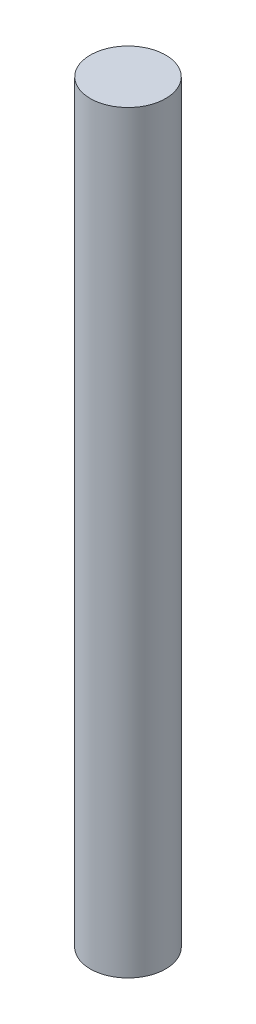
ISO-10303-21;
HEADER;
FILE_DESCRIPTION(('STEP AP214'),'2;1');
FILE_NAME('part.step','',(''),(''),'','','');
FILE_SCHEMA(('AUTOMOTIVE_DESIGN { 1 0 10303 214 1 1 1 1 }'));
ENDSEC;
DATA;
#1=APPLICATION_CONTEXT('core data for automotive mechanical design processes');
#2=APPLICATION_PROTOCOL_DEFINITION('international standard','automotive_design',2000,#1);
#3=PRODUCT_CONTEXT('',#1,'mechanical');
#4=PRODUCT('Part','Part','',(#3));
#5=PRODUCT_RELATED_PRODUCT_CATEGORY('part','',(#4));
#6=PRODUCT_DEFINITION_FORMATION('','',#4);
#7=PRODUCT_DEFINITION_CONTEXT('part definition',#1,'design');
#8=PRODUCT_DEFINITION('design','',#6,#7);
#9=PRODUCT_DEFINITION_SHAPE('','',#8);
#10=(LENGTH_UNIT() NAMED_UNIT(*) SI_UNIT(.MILLI.,.METRE.));
#11=(NAMED_UNIT(*) PLANE_ANGLE_UNIT() SI_UNIT($,.RADIAN.));
#12=(NAMED_UNIT(*) SI_UNIT($,.STERADIAN.) SOLID_ANGLE_UNIT());
#13=UNCERTAINTY_MEASURE_WITH_UNIT(LENGTH_MEASURE(1.E-05),#10,'distance_accuracy_value','');
#14=(GEOMETRIC_REPRESENTATION_CONTEXT(3) GLOBAL_UNCERTAINTY_ASSIGNED_CONTEXT((#13)) GLOBAL_UNIT_ASSIGNED_CONTEXT((#10,
#11,#12)) REPRESENTATION_CONTEXT('',''));
#15=CARTESIAN_POINT('',(0.,0.,0.));
#16=DIRECTION('',(0.,0.,1.));
#17=DIRECTION('',(1.,0.,0.));
#18=AXIS2_PLACEMENT_3D('',#15,#16,#17);
#19=CARTESIAN_POINT('',(0.,30.,0.));
#20=DIRECTION('',(0.,-1.,0.));
#21=DIRECTION('',(0.,0.,-1.));
#22=AXIS2_PLACEMENT_3D('',#19,#20,#21);
#23=CYLINDRICAL_SURFACE('',#22,1.5);
#24=CARTESIAN_POINT('',(0.,30.,0.));
#25=DIRECTION('',(0.,1.,0.));
#26=DIRECTION('',(0.,0.,1.));
#27=AXIS2_PLACEMENT_3D('',#24,#25,#26);
#28=CIRCLE('',#27,1.5);
#29=CARTESIAN_POINT('',(0.,30.,1.5));
#30=VERTEX_POINT('',#29);
#31=EDGE_CURVE('E10',#30,#30,#28,.T.);
#32=ORIENTED_EDGE('',*,*,#31,.F.);
#33=EDGE_LOOP('',(#32));
#34=FACE_BOUND('',#33,.T.);
#35=CARTESIAN_POINT('',(0.,0.,0.));
#36=DIRECTION('',(0.,1.,0.));
#37=DIRECTION('',(0.,0.,1.));
#38=AXIS2_PLACEMENT_3D('',#35,#36,#37);
#39=CIRCLE('',#38,1.5);
#40=CARTESIAN_POINT('',(0.,0.,1.5));
#41=VERTEX_POINT('',#40);
#42=EDGE_CURVE('E32',#41,#41,#39,.T.);
#43=ORIENTED_EDGE('',*,*,#42,.T.);
#44=EDGE_LOOP('',(#43));
#45=FACE_BOUND('',#44,.T.);
#46=ADVANCED_FACE('F29',(#34,#45),#23,.T.);
#47=CARTESIAN_POINT('',(0.,30.,0.));
#48=DIRECTION('',(0.,1.,0.));
#49=DIRECTION('',(0.,0.,1.));
#50=AXIS2_PLACEMENT_3D('',#47,#48,#49);
#51=PLANE('',#50);
#52=ORIENTED_EDGE('',*,*,#31,.T.);
#53=EDGE_LOOP('',(#52));
#54=FACE_BOUND('',#53,.T.);
#55=ADVANCED_FACE('F44',(#54),#51,.T.);
#56=CARTESIAN_POINT('',(0.,0.,0.));
#57=DIRECTION('',(0.,1.,0.));
#58=DIRECTION('',(0.,0.,1.));
#59=AXIS2_PLACEMENT_3D('',#56,#57,#58);
#60=PLANE('',#59);
#61=ORIENTED_EDGE('',*,*,#42,.F.);
#62=EDGE_LOOP('',(#61));
#63=FACE_BOUND('',#62,.T.);
#64=ADVANCED_FACE('F42',(#63),#60,.F.);
#65=CLOSED_SHELL('',(#46,#55,#64));
#66=MANIFOLD_SOLID_BREP('B2',#65);
#67=ADVANCED_BREP_SHAPE_REPRESENTATION('',(#18,#66),#14);
#68=SHAPE_DEFINITION_REPRESENTATION(#9,#67);
ENDSEC;
END-ISO-10303-21;
